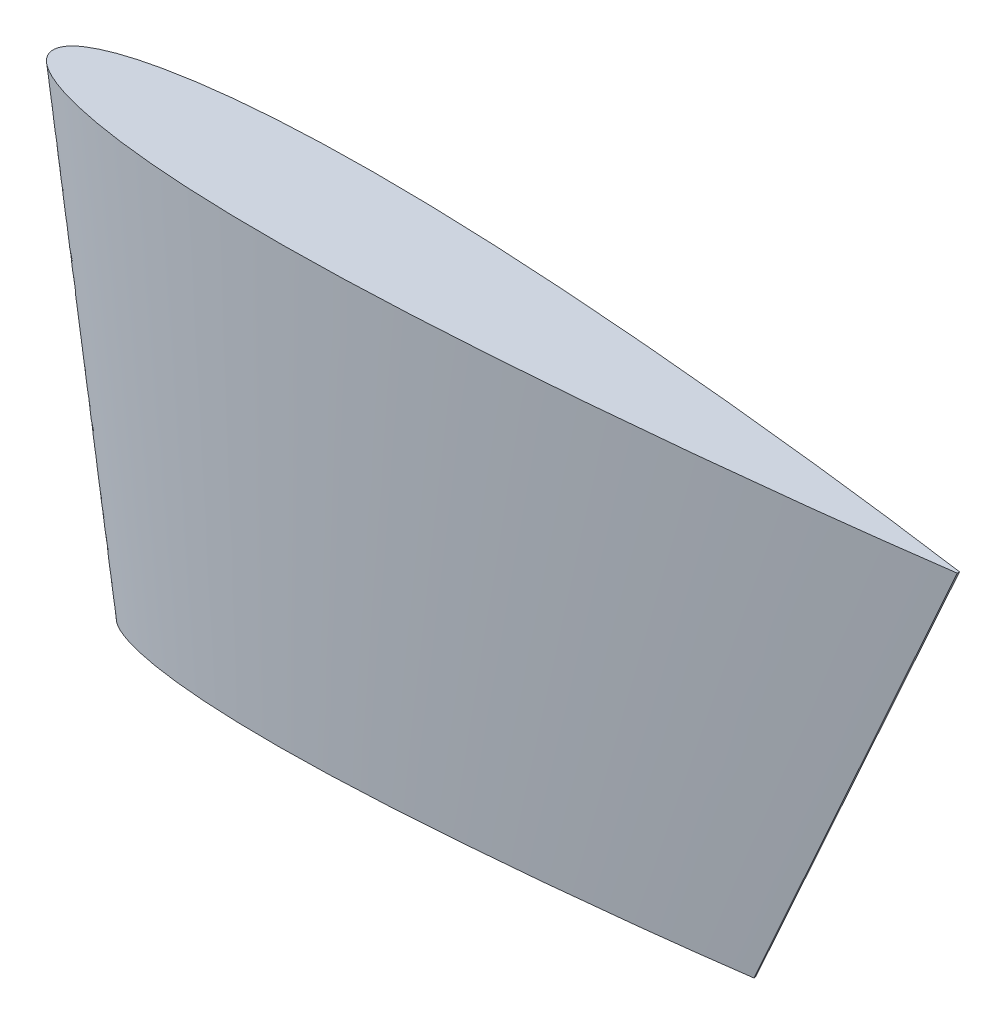
ISO-10303-21;
HEADER;
FILE_DESCRIPTION(('STEP AP214'),'2;1');
FILE_NAME('part.step','',(''),(''),'','','');
FILE_SCHEMA(('AUTOMOTIVE_DESIGN { 1 0 10303 214 1 1 1 1 }'));
ENDSEC;
DATA;
#1=APPLICATION_CONTEXT('core data for automotive mechanical design processes');
#2=APPLICATION_PROTOCOL_DEFINITION('international standard','automotive_design',2000,#1);
#3=PRODUCT_CONTEXT('',#1,'mechanical');
#4=PRODUCT('Part','Part','',(#3));
#5=PRODUCT_RELATED_PRODUCT_CATEGORY('part','',(#4));
#6=PRODUCT_DEFINITION_FORMATION('','',#4);
#7=PRODUCT_DEFINITION_CONTEXT('part definition',#1,'design');
#8=PRODUCT_DEFINITION('design','',#6,#7);
#9=PRODUCT_DEFINITION_SHAPE('','',#8);
#10=(LENGTH_UNIT() NAMED_UNIT(*) SI_UNIT(.MILLI.,.METRE.));
#11=(NAMED_UNIT(*) PLANE_ANGLE_UNIT() SI_UNIT($,.RADIAN.));
#12=(NAMED_UNIT(*) SI_UNIT($,.STERADIAN.) SOLID_ANGLE_UNIT());
#13=UNCERTAINTY_MEASURE_WITH_UNIT(LENGTH_MEASURE(1.E-05),#10,'distance_accuracy_value','');
#14=(GEOMETRIC_REPRESENTATION_CONTEXT(3) GLOBAL_UNCERTAINTY_ASSIGNED_CONTEXT((#13)) GLOBAL_UNIT_ASSIGNED_CONTEXT((#10,
#11,#12)) REPRESENTATION_CONTEXT('',''));
#15=CARTESIAN_POINT('',(0.,0.,0.));
#16=DIRECTION('',(0.,0.,1.));
#17=DIRECTION('',(1.,0.,0.));
#18=AXIS2_PLACEMENT_3D('',#15,#16,#17);
#19=CARTESIAN_POINT('',(0.,0.,0.));
#20=DIRECTION('',(0.,-1.,0.));
#21=DIRECTION('',(0.,0.,-1.));
#22=AXIS2_PLACEMENT_3D('',#19,#20,#21);
#23=PLANE('',#22);
#24=CARTESIAN_POINT('',(152.4,0.,-0.192024));
#25=CARTESIAN_POINT('',(152.370338532884,0.,-0.196184563385604));
#26=CARTESIAN_POINT('',(152.251762960969,0.,-0.212816956550669));
#27=CARTESIAN_POINT('',(151.985232617594,0.,-0.250135614248015));
#28=CARTESIAN_POINT('',(151.541705058351,0.,-0.312085758378577));
#29=CARTESIAN_POINT('',(150.922222429012,0.,-0.398241424578179));
#30=CARTESIAN_POINT('',(150.128220411239,0.,-0.508012662753263));
#31=CARTESIAN_POINT('',(149.161562003337,0.,-0.640702570563287));
#32=CARTESIAN_POINT('',(148.024507935647,0.,-0.795534669857211));
#33=CARTESIAN_POINT('',(146.719698791256,0.,-0.971424113968059));
#34=CARTESIAN_POINT('',(145.25019475784,0.,-1.1674204385122));
#35=CARTESIAN_POINT('',(143.619413968927,0.,-1.38223376352503));
#36=CARTESIAN_POINT('',(141.831182800838,0.,-1.61476826783448));
#37=CARTESIAN_POINT('',(139.889652062668,0.,-1.8635205673098));
#38=CARTESIAN_POINT('',(137.799380396863,0.,-2.12726694462141));
#39=CARTESIAN_POINT('',(135.565236862677,0.,-2.40450872510127));
#40=CARTESIAN_POINT('',(133.192452429258,0.,-2.69386916426055));
#41=CARTESIAN_POINT('',(130.686544779266,0.,-2.9938087865262));
#42=CARTESIAN_POINT('',(128.053380448325,0.,-3.30284675801258));
#43=CARTESIAN_POINT('',(125.299116362894,0.,-3.61951535979661));
#44=CARTESIAN_POINT('',(122.430184480662,0.,-3.94226355136388));
#45=CARTESIAN_POINT('',(119.453275170209,0.,-4.26951458798322));
#46=CARTESIAN_POINT('',(116.375340626462,0.,-4.59979345655401));
#47=CARTESIAN_POINT('',(113.203576723111,0.,-4.93145849917861));
#48=CARTESIAN_POINT('',(109.945388053378,0.,-5.26288658298469));
#49=CARTESIAN_POINT('',(106.60839667466,0.,-5.59251116300805));
#50=CARTESIAN_POINT('',(103.200380957095,0.,-5.91855985842198));
#51=CARTESIAN_POINT('',(99.7293068740157,0.,-6.23944251709353));
#52=CARTESIAN_POINT('',(96.2032774745244,0.,-6.55326476083705));
#53=CARTESIAN_POINT('',(92.630532155618,0.,-6.85832087139749));
#54=CARTESIAN_POINT('',(89.0194131753144,0.,-7.15270200600455));
#55=CARTESIAN_POINT('',(85.3783502256352,0.,-7.43448213806294));
#56=CARTESIAN_POINT('',(81.7158494354458,0.,-7.70181737177012));
#57=CARTESIAN_POINT('',(78.0404599993123,0.,-7.95266743240307));
#58=CARTESIAN_POINT('',(74.3607612767116,0.,-8.18506664642728));
#59=CARTESIAN_POINT('',(70.6853551822504,0.,-8.39706870917708));
#60=CARTESIAN_POINT('',(67.0228164188249,0.,-8.58667155402267));
#61=CARTESIAN_POINT('',(63.3817016128138,0.,-8.75198275199724));
#62=CARTESIAN_POINT('',(59.7705078425938,0.,-8.89112223462125));
#63=CARTESIAN_POINT('',(56.1976698657798,0.,-9.00227212001563));
#64=CARTESIAN_POINT('',(52.6715243428957,0.,-9.08385022068028));
#65=CARTESIAN_POINT('',(49.2003022837029,0.,-9.13428952981387));
#66=CARTESIAN_POINT('',(45.7921123589265,0.,-9.15223580287476));
#67=CARTESIAN_POINT('',(42.4549164263596,0.,-9.13648584820609));
#68=CARTESIAN_POINT('',(39.1965000595328,0.,-9.08613390208933));
#69=CARTESIAN_POINT('',(36.0244643360914,0.,-9.00035979398917));
#70=CARTESIAN_POINT('',(32.9462162558346,0.,-8.87872105763061));
#71=CARTESIAN_POINT('',(29.9689449155695,0.,-8.72100406191527));
#72=CARTESIAN_POINT('',(27.0996036285085,0.,-8.52713483857808));
#73=CARTESIAN_POINT('',(24.3448742926058,0.,-8.29746913936489));
#74=CARTESIAN_POINT('',(21.7111668043941,0.,-8.03254441540473));
#75=CARTESIAN_POINT('',(19.2046291393943,0.,-7.73308064875823));
#76=CARTESIAN_POINT('',(16.8310926599184,0.,-7.40012109616049));
#77=CARTESIAN_POINT('',(14.5960714001381,0.,-7.03484136390966));
#78=CARTESIAN_POINT('',(12.5047241133301,0.,-6.63872383729163));
#79=CARTESIAN_POINT('',(10.561886109842,0.,-6.21318266255167));
#80=CARTESIAN_POINT('',(8.77197428686925,0.,-5.76001216914782));
#81=CARTESIAN_POINT('',(7.13905865945553,0.,-5.28081110509763));
#82=CARTESIAN_POINT('',(5.66673210247375,0.,-4.7774092903727));
#83=CARTESIAN_POINT('',(4.35813743166818,0.,-4.25148725734631));
#84=CARTESIAN_POINT('',(3.21587138800854,0.,-3.70461578837938));
#85=CARTESIAN_POINT('',(2.24194242662648,0.,-3.13804579452405));
#86=CARTESIAN_POINT('',(1.43780829591548,0.,-2.55238578121201));
#87=CARTESIAN_POINT('',(0.804597287250528,0.,-1.94712103074528));
#88=CARTESIAN_POINT('',(0.344416163725508,0.,-1.32007991138518));
#89=CARTESIAN_POINT('',(0.0627824183608324,0.,-0.668579036576483));
#90=CARTESIAN_POINT('',(-0.0306049034041423,0.,0.));
#91=CARTESIAN_POINT('',(0.0627824183608382,0.,0.668579036576509));
#92=CARTESIAN_POINT('',(0.344416163725502,0.,1.32007991138516));
#93=CARTESIAN_POINT('',(0.80459728725053,0.,1.94712103074529));
#94=CARTESIAN_POINT('',(1.43780829591547,0.,2.552385781212));
#95=CARTESIAN_POINT('',(2.24194242662649,0.,3.13804579452406));
#96=CARTESIAN_POINT('',(3.21587138800854,0.,3.70461578837937));
#97=CARTESIAN_POINT('',(4.3581374316682,0.,4.25148725734631));
#98=CARTESIAN_POINT('',(5.66673210247373,0.,4.77740929037269));
#99=CARTESIAN_POINT('',(7.13905865945555,0.,5.28081110509764));
#100=CARTESIAN_POINT('',(8.77197428686923,0.,5.76001216914782));
#101=CARTESIAN_POINT('',(10.561886109842,0.,6.21318266255167));
#102=CARTESIAN_POINT('',(12.5047241133301,0.,6.63872383729163));
#103=CARTESIAN_POINT('',(14.5960714001381,0.,7.03484136390966));
#104=CARTESIAN_POINT('',(16.8310926599184,0.,7.40012109616049));
#105=CARTESIAN_POINT('',(19.2046291393944,0.,7.73308064875823));
#106=CARTESIAN_POINT('',(21.7111668043941,0.,8.03254441540473));
#107=CARTESIAN_POINT('',(24.3448742926058,0.,8.29746913936489));
#108=CARTESIAN_POINT('',(27.0996036285085,0.,8.52713483857808));
#109=CARTESIAN_POINT('',(29.9689449155695,0.,8.72100406191526));
#110=CARTESIAN_POINT('',(32.9462162558347,0.,8.87872105763062));
#111=CARTESIAN_POINT('',(36.0244643360914,0.,9.00035979398917));
#112=CARTESIAN_POINT('',(39.1965000595328,0.,9.08613390208933));
#113=CARTESIAN_POINT('',(42.4549164263596,0.,9.13648584820609));
#114=CARTESIAN_POINT('',(45.7921123589264,0.,9.15223580287476));
#115=CARTESIAN_POINT('',(49.2003022837029,0.,9.13428952981386));
#116=CARTESIAN_POINT('',(52.6715243428957,0.,9.08385022068028));
#117=CARTESIAN_POINT('',(56.1976698657799,0.,9.00227212001563));
#118=CARTESIAN_POINT('',(59.7705078425938,0.,8.89112223462125));
#119=CARTESIAN_POINT('',(63.3817016128138,0.,8.75198275199725));
#120=CARTESIAN_POINT('',(67.0228164188249,0.,8.58667155402266));
#121=CARTESIAN_POINT('',(70.6853551822504,0.,8.39706870917708));
#122=CARTESIAN_POINT('',(74.3607612767117,0.,8.18506664642728));
#123=CARTESIAN_POINT('',(78.0404599993123,0.,7.95266743240307));
#124=CARTESIAN_POINT('',(81.7158494354458,0.,7.70181737177012));
#125=CARTESIAN_POINT('',(85.3783502256352,0.,7.43448213806294));
#126=CARTESIAN_POINT('',(89.0194131753143,0.,7.15270200600455));
#127=CARTESIAN_POINT('',(92.630532155618,0.,6.85832087139749));
#128=CARTESIAN_POINT('',(96.2032774745246,0.,6.55326476083705));
#129=CARTESIAN_POINT('',(99.7293068740156,0.,6.23944251709353));
#130=CARTESIAN_POINT('',(103.200380957095,0.,5.91855985842198));
#131=CARTESIAN_POINT('',(106.60839667466,0.,5.59251116300806));
#132=CARTESIAN_POINT('',(109.945388053378,0.,5.26288658298468));
#133=CARTESIAN_POINT('',(113.203576723111,0.,4.93145849917861));
#134=CARTESIAN_POINT('',(116.375340626462,0.,4.59979345655401));
#135=CARTESIAN_POINT('',(119.453275170209,0.,4.26951458798322));
#136=CARTESIAN_POINT('',(122.430184480662,0.,3.94226355136388));
#137=CARTESIAN_POINT('',(125.299116362894,0.,3.61951535979661));
#138=CARTESIAN_POINT('',(128.053380448325,0.,3.30284675801258));
#139=CARTESIAN_POINT('',(130.686544779266,0.,2.9938087865262));
#140=CARTESIAN_POINT('',(133.192452429258,0.,2.69386916426055));
#141=CARTESIAN_POINT('',(135.565236862677,0.,2.40450872510127));
#142=CARTESIAN_POINT('',(137.799380396863,0.,2.12726694462141));
#143=CARTESIAN_POINT('',(139.889652062668,0.,1.8635205673098));
#144=CARTESIAN_POINT('',(141.831182800838,0.,1.61476826783449));
#145=CARTESIAN_POINT('',(143.619413968928,0.,1.38223376352503));
#146=CARTESIAN_POINT('',(145.25019475784,0.,1.1674204385122));
#147=CARTESIAN_POINT('',(146.719698791256,0.,0.971424113968061));
#148=CARTESIAN_POINT('',(148.024507935647,0.,0.795534669857208));
#149=CARTESIAN_POINT('',(149.161562003336,0.,0.640702570563289));
#150=CARTESIAN_POINT('',(150.128220411239,0.,0.508012662753264));
#151=CARTESIAN_POINT('',(150.922222429012,0.,0.398241424578179));
#152=CARTESIAN_POINT('',(151.54170505835,0.,0.31208575837858));
#153=CARTESIAN_POINT('',(151.985232617594,0.,0.250135614248006));
#154=CARTESIAN_POINT('',(152.251762960969,0.,0.212816956550677));
#155=CARTESIAN_POINT('',(152.370338532884,0.,0.196184563385604));
#156=CARTESIAN_POINT('',(152.4,0.,0.192024));
#157=B_SPLINE_CURVE_WITH_KNOTS('',3,(#24,#25,#26,#27,#28,#29,#30,#31,#32,#33,#34,#35,#36,#37,
#38,#39,#40,#41,#42,#43,#44,#45,#46,#47,#48,#49,#50,#51,#52,#53,#54,#55,#56,#57,#58,#59,#60,#61,
#62,#63,#64,#65,#66,#67,#68,#69,#70,#71,#72,#73,#74,#75,#76,#77,#78,#79,#80,#81,#82,#83,#84,#85,
#86,#87,#88,#89,#90,#91,#92,#93,#94,#95,#96,#97,#98,#99,#100,#101,#102,#103,#104,#105,#106,#107,
#108,#109,#110,#111,#112,#113,#114,#115,#116,#117,#118,#119,#120,#121,#122,#123,#124,#125,#126,
#127,#128,#129,#130,#131,#132,#133,#134,#135,#136,#137,#138,#139,#140,#141,#142,#143,#144,#145,
#146,#147,#148,#149,#150,#151,#152,#153,#154,#155,#156),.UNSPECIFIED.,.F.,.F.,(4,1,1,1,1,1,1,1,
1,1,1,1,1,1,1,1,1,1,1,1,1,1,1,1,1,1,1,1,1,1,1,1,1,1,1,1,1,1,1,1,1,1,1,1,1,1,1,1,1,1,1,1,1,1,1,1,
1,1,1,1,1,1,1,1,1,1,1,1,1,1,1,1,1,1,1,1,1,1,1,1,1,1,1,1,1,1,1,1,1,1,1,1,1,1,1,1,1,1,1,1,1,1,1,1,
1,1,1,1,1,1,1,1,1,1,1,1,1,1,1,1,1,1,1,1,1,1,1,1,1,1,4),(0.,0.000289139829629297,
0.00115587406809233,0.00259804648620111,0.0046122925242988,0.00719360142710374,
0.0103358398991138,0.0140314220913043,0.0182714359610244,0.0230457255123808,0.028342880171931,
0.0341501461629426,0.0404537273712038,0.0472386218431875,0.0544885452057086,0.0621864184567662,
0.0703139502736332,0.0788519467249039,0.0877800883609476,0.0970773446039016,0.106721824454286,
0.116690740892026,0.126960694728489,0.13750732119189,0.14830589784927,0.159331037464912,
0.170556733734794,0.181956692412489,0.193504006621146,0.205171610926845,0.216932143777857,
0.228757966329757,0.240621466795955,0.252494880114754,0.264350513454881,0.276160748683231,
0.287898286461392,0.299535932758038,0.311046943870827,0.322404990071825,0.333584264347777,
0.344559445097454,0.355305867410276,0.365799637181357,0.376017640202703,0.385937539745688,
0.395537839242619,0.404798063044776,0.413698795251114,0.422221663138462,0.430349482374301,
0.438066166572283,0.445357142004528,0.452209429052352,0.458611476419824,0.46455400548229,
0.470029947259275,0.475035104452568,0.479569182705939,0.483636922291976,0.487250217431857,
0.490431510097779,0.49321884899948,0.495674068819139,0.49789121366491,0.5,0.50210878633509,
0.504325931180861,0.50678115100052,0.50956848990222,0.512749782568143,0.516363077708024,
0.520430817294061,0.524964895547432,0.529970052740725,0.53544599451771,0.541388523580176,
0.547790570947647,0.554642857995472,0.561933833427716,0.569650517625699,0.577778336861538,
0.586301204748886,0.595201936955223,0.604462160757381,0.614062460254312,0.623982359797297,
0.634200362818643,0.644694132589724,0.655440554902546,0.666415735652223,0.677595009928175,
0.688953056129173,0.700464067241962,0.712101713538608,0.723839251316769,0.735649486545119,
0.747505119885246,0.759378533204045,0.771242033670243,0.783067856222143,0.794828389073155,
0.806495993378855,0.818043307587511,0.829443266265206,0.840668962535088,0.85169410215073,
0.86249267880811,0.873039305271511,0.883309259107974,0.893278175545714,0.902922655396098,
0.912219911639052,0.921148053275096,0.929686049726367,0.937813581543234,0.945511454794291,
0.952761378156812,0.959546272628796,0.965849853837057,0.971657119828069,0.976954274487619,
0.981728564038976,0.985968577908696,0.989664160100886,0.992806398572896,0.995387707475701,
0.997401953513799,0.998844125931908,0.999710860170371,1.),.UNSPECIFIED.);
#158=CARTESIAN_POINT('',(152.4,0.,-0.192024));
#159=VERTEX_POINT('',#158);
#160=CARTESIAN_POINT('',(152.4,0.,0.192024));
#161=VERTEX_POINT('',#160);
#162=EDGE_CURVE('E61',#159,#161,#157,.T.);
#163=ORIENTED_EDGE('',*,*,#162,.T.);
#164=DIRECTION('',(0.,0.,-1.));
#165=VECTOR('',#164,1.);
#166=CARTESIAN_POINT('',(152.4,0.,-0.192024));
#167=LINE('',#166,#165);
#168=EDGE_CURVE('E12',#161,#159,#167,.T.);
#169=ORIENTED_EDGE('',*,*,#168,.T.);
#170=EDGE_LOOP('',(#163,#169));
#171=FACE_BOUND('',#170,.T.);
#172=ADVANCED_FACE('F51',(#171),#23,.F.);
#173=CARTESIAN_POINT('',(11.4300000000023,-76.1999999999994,0.));
#174=DIRECTION('',(0.,-1.,0.));
#175=DIRECTION('',(0.,0.,-1.));
#176=AXIS2_PLACEMENT_3D('',#173,#174,#175);
#177=PLANE('',#176);
#178=CARTESIAN_POINT('',(118.110000000002,-76.1999999999994,-0.1344168));
#179=CARTESIAN_POINT('',(118.089236973021,-76.1999999999994,-0.137329194369924));
#180=CARTESIAN_POINT('',(118.006234072681,-76.1999999999994,-0.148971869585466));
#181=CARTESIAN_POINT('',(117.819662832318,-76.1999999999994,-0.175094929973612));
#182=CARTESIAN_POINT('',(117.509193540848,-76.1999999999994,-0.218460030865003));
#183=CARTESIAN_POINT('',(117.07555570031,-76.1999999999994,-0.278768997204722));
#184=CARTESIAN_POINT('',(116.519754287869,-76.1999999999994,-0.355608863927284));
#185=CARTESIAN_POINT('',(115.843093402338,-76.1999999999994,-0.448491799394302));
#186=CARTESIAN_POINT('',(115.047155554955,-76.1999999999994,-0.556874268900048));
#187=CARTESIAN_POINT('',(114.133789153882,-76.1999999999994,-0.679996879777643));
#188=CARTESIAN_POINT('',(113.10513633049,-76.1999999999994,-0.817194306958535));
#189=CARTESIAN_POINT('',(111.963589778252,-76.1999999999994,-0.967563634467527));
#190=CARTESIAN_POINT('',(110.711827960589,-76.1999999999994,-1.13033778748414));
#191=CARTESIAN_POINT('',(109.35275644387,-76.1999999999994,-1.30446439711687));
#192=CARTESIAN_POINT('',(107.889566277807,-76.1999999999994,-1.48908686123499));
#193=CARTESIAN_POINT('',(106.325665803876,-76.1999999999994,-1.68315610757089));
#194=CARTESIAN_POINT('',(104.664716700483,-76.1999999999994,-1.88570841498238));
#195=CARTESIAN_POINT('',(102.910581345489,-76.1999999999994,-2.09566615056835));
#196=CARTESIAN_POINT('',(101.06736631383,-76.1999999999994,-2.31199273060878));
#197=CARTESIAN_POINT('',(99.1393814540284,-76.1999999999994,-2.53366075185763));
#198=CARTESIAN_POINT('',(97.1311291364658,-76.1999999999994,-2.75958448595473));
#199=CARTESIAN_POINT('',(95.0472926191489,-76.1999999999994,-2.98866021158825));
#200=CARTESIAN_POINT('',(92.8927384385256,-76.1999999999994,-3.21985541958779));
#201=CARTESIAN_POINT('',(90.67250370618,-76.1999999999994,-3.45202094942502));
#202=CARTESIAN_POINT('',(88.3917716373661,-76.1999999999994,-3.68402060808926));
#203=CARTESIAN_POINT('',(86.0558776722644,-76.1999999999994,-3.91475781410564));
#204=CARTESIAN_POINT('',(83.6702666699684,-76.1999999999994,-4.14299190089537));
#205=CARTESIAN_POINT('',(81.2405148118139,-76.1999999999994,-4.36760976196542));
#206=CARTESIAN_POINT('',(78.7722942321698,-76.1999999999994,-4.58728533258594));
#207=CARTESIAN_POINT('',(76.271372508935,-76.1999999999994,-4.80082460997821));
#208=CARTESIAN_POINT('',(73.7435892227221,-76.1999999999994,-5.00689140420312));
#209=CARTESIAN_POINT('',(71.1948451579466,-76.1999999999994,-5.20413749664405));
#210=CARTESIAN_POINT('',(68.6310946048146,-76.1999999999994,-5.39127216023905));
#211=CARTESIAN_POINT('',(66.0583219995208,-76.1999999999994,-5.5668672026822));
#212=CARTESIAN_POINT('',(63.4825328937004,-76.1999999999994,-5.72954665249912));
#213=CARTESIAN_POINT('',(60.9097486275773,-76.1999999999994,-5.87794809642394));
#214=CARTESIAN_POINT('',(58.3459714931796,-76.1999999999994,-6.01067008781586));
#215=CARTESIAN_POINT('',(55.7971911289716,-76.1999999999994,-6.12638792639808));
#216=CARTESIAN_POINT('',(53.2693554898181,-76.1999999999994,-6.22378556423486));
#217=CARTESIAN_POINT('',(50.7683689060483,-76.1999999999994,-6.30159048401092));
#218=CARTESIAN_POINT('',(48.3000670400285,-76.1999999999994,-6.35869515447621));
#219=CARTESIAN_POINT('',(45.8702115985942,-76.1999999999994,-6.39400267086971));
#220=CARTESIAN_POINT('',(43.4844786512511,-76.1999999999994,-6.4065650620123));
#221=CARTESIAN_POINT('',(41.148441498454,-76.1999999999994,-6.39554009374426));
#222=CARTESIAN_POINT('',(38.8675500416747,-76.1999999999994,-6.3602937314625));
#223=CARTESIAN_POINT('',(36.6471250352664,-76.1999999999994,-6.30025185579241));
#224=CARTESIAN_POINT('',(34.4923513790868,-76.1999999999994,-6.21510474034138));
#225=CARTESIAN_POINT('',(32.4082614409003,-76.1999999999994,-6.10470284334067));
#226=CARTESIAN_POINT('',(30.3997225399586,-76.1999999999994,-5.96899438700465));
#227=CARTESIAN_POINT('',(28.4714120048262,-76.1999999999994,-5.80822839755542));
#228=CARTESIAN_POINT('',(26.6278167630781,-76.1999999999994,-5.62278109078331));
#229=CARTESIAN_POINT('',(24.8732403975783,-76.1999999999994,-5.41315645413071));
#230=CARTESIAN_POINT('',(23.2117648619452,-76.1999999999994,-5.18008476731229));
#231=CARTESIAN_POINT('',(21.6472499800985,-76.1999999999994,-4.92438895473677));
#232=CARTESIAN_POINT('',(20.1833068793331,-76.1999999999994,-4.64710668610409));
#233=CARTESIAN_POINT('',(18.8233202768918,-76.1999999999994,-4.34922786378616));
#234=CARTESIAN_POINT('',(17.5703820008114,-76.1999999999994,-4.03200851840346));
#235=CARTESIAN_POINT('',(16.427341061621,-76.1999999999994,-3.69656777356831));
#236=CARTESIAN_POINT('',(15.3967124717339,-76.1999999999994,-3.34418650326087));
#237=CARTESIAN_POINT('',(14.4806962021704,-76.1999999999994,-2.97604108014237));
#238=CARTESIAN_POINT('',(13.681109971608,-76.1999999999994,-2.59323105186556));
#239=CARTESIAN_POINT('',(12.9993596986405,-76.1999999999994,-2.1966320561668));
#240=CARTESIAN_POINT('',(12.4364658071427,-76.1999999999994,-1.78667004684839));
#241=CARTESIAN_POINT('',(11.9932181010775,-76.1999999999994,-1.36298472152169));
#242=CARTESIAN_POINT('',(11.6710913146101,-76.1999999999994,-0.924055937969606));
#243=CARTESIAN_POINT('',(11.4739476928552,-76.1999999999994,-0.468005325603518));
#244=CARTESIAN_POINT('',(11.4085765676194,-76.1999999999994,0.));
#245=CARTESIAN_POINT('',(11.4739476928546,-76.1999999999994,0.468005325603575));
#246=CARTESIAN_POINT('',(11.6710913146097,-76.1999999999994,0.924055937969634));
#247=CARTESIAN_POINT('',(11.9932181010781,-76.1999999999994,1.36298472152173));
#248=CARTESIAN_POINT('',(12.4364658071434,-76.1999999999994,1.78667004684842));
#249=CARTESIAN_POINT('',(12.9993596986403,-76.1999999999994,2.19663205616686));
#250=CARTESIAN_POINT('',(13.6811099716084,-76.1999999999994,2.59323105186558));
#251=CARTESIAN_POINT('',(14.48069620217,-76.1999999999994,2.97604108014245));
#252=CARTESIAN_POINT('',(15.3967124717334,-76.1999999999994,3.3441865032609));
#253=CARTESIAN_POINT('',(16.427341061622,-76.1999999999994,3.69656777356839));
#254=CARTESIAN_POINT('',(17.5703820008107,-76.1999999999994,4.03200851840348));
#255=CARTESIAN_POINT('',(18.8233202768914,-76.1999999999994,4.34922786378619));
#256=CARTESIAN_POINT('',(20.1833068793327,-76.1999999999994,4.64710668610416));
#257=CARTESIAN_POINT('',(21.6472499800988,-76.1999999999994,4.92438895473679));
#258=CARTESIAN_POINT('',(23.2117648619453,-76.1999999999994,5.18008476731236));
#259=CARTESIAN_POINT('',(24.8732403975778,-76.1999999999994,5.41315645413077));
#260=CARTESIAN_POINT('',(26.6278167630779,-76.1999999999994,5.62278109078331));
#261=CARTESIAN_POINT('',(28.4714120048264,-76.1999999999994,5.80822839755545));
#262=CARTESIAN_POINT('',(30.3997225399576,-76.1999999999994,5.96899438700465));
#263=CARTESIAN_POINT('',(32.4082614409008,-76.1999999999994,6.10470284334072));
#264=CARTESIAN_POINT('',(34.4923513790866,-76.1999999999994,6.21510474034146));
#265=CARTESIAN_POINT('',(36.6471250352675,-76.1999999999994,6.3002518557924));
#266=CARTESIAN_POINT('',(38.8675500416749,-76.1999999999994,6.36029373146252));
#267=CARTESIAN_POINT('',(41.1484414984542,-76.1999999999994,6.3955400937443));
#268=CARTESIAN_POINT('',(43.4844786512509,-76.1999999999994,6.40656506201235));
#269=CARTESIAN_POINT('',(45.8702115985946,-76.1999999999994,6.39400267086974));
#270=CARTESIAN_POINT('',(48.3000670400292,-76.1999999999994,6.35869515447622));
#271=CARTESIAN_POINT('',(50.7683689060489,-76.1999999999994,6.30159048401095));
#272=CARTESIAN_POINT('',(53.2693554898178,-76.1999999999994,6.22378556423484));
#273=CARTESIAN_POINT('',(55.7971911289719,-76.1999999999994,6.12638792639808));
#274=CARTESIAN_POINT('',(58.3459714931798,-76.1999999999994,6.01067008781587));
#275=CARTESIAN_POINT('',(60.9097486275777,-76.1999999999994,5.87794809642397));
#276=CARTESIAN_POINT('',(63.4825328937007,-76.1999999999994,5.72954665249908));
#277=CARTESIAN_POINT('',(66.0583219995211,-76.1999999999994,5.56686720268216));
#278=CARTESIAN_POINT('',(68.6310946048141,-76.1999999999994,5.39127216023913));
#279=CARTESIAN_POINT('',(71.1948451579467,-76.1999999999994,5.2041374966441));
#280=CARTESIAN_POINT('',(73.7435892227224,-76.1999999999994,5.00689140420322));
#281=CARTESIAN_POINT('',(76.2713725089349,-76.1999999999994,4.80082460997827));
#282=CARTESIAN_POINT('',(78.7722942321696,-76.1999999999994,4.58728533258591));
#283=CARTESIAN_POINT('',(81.2405148118129,-76.1999999999994,4.36760976196549));
#284=CARTESIAN_POINT('',(83.6702666699691,-76.1999999999994,4.14299190089539));
#285=CARTESIAN_POINT('',(86.0558776722649,-76.1999999999994,3.91475781410566));
#286=CARTESIAN_POINT('',(88.3917716373674,-76.1999999999994,3.68402060808928));
#287=CARTESIAN_POINT('',(90.6725037061801,-76.1999999999994,3.45202094942502));
#288=CARTESIAN_POINT('',(92.8927384385253,-76.1999999999994,3.21985541958781));
#289=CARTESIAN_POINT('',(95.0472926191482,-76.1999999999994,2.98866021158824));
#290=CARTESIAN_POINT('',(97.1311291364657,-76.1999999999994,2.75958448595473));
#291=CARTESIAN_POINT('',(99.1393814540278,-76.1999999999994,2.53366075185762));
#292=CARTESIAN_POINT('',(101.06736631383,-76.1999999999994,2.31199273060881));
#293=CARTESIAN_POINT('',(102.910581345488,-76.1999999999994,2.09566615056833));
#294=CARTESIAN_POINT('',(104.664716700484,-76.1999999999994,1.88570841498237));
#295=CARTESIAN_POINT('',(106.325665803876,-76.1999999999994,1.68315610757088));
#296=CARTESIAN_POINT('',(107.889566277806,-76.1999999999994,1.48908686123499));
#297=CARTESIAN_POINT('',(109.35275644387,-76.1999999999994,1.30446439711685));
#298=CARTESIAN_POINT('',(110.711827960589,-76.1999999999994,1.13033778748414));
#299=CARTESIAN_POINT('',(111.963589778252,-76.1999999999994,0.96756363446752));
#300=CARTESIAN_POINT('',(113.10513633049,-76.1999999999994,0.817194306958542));
#301=CARTESIAN_POINT('',(114.133789153882,-76.1999999999994,0.679996879777642));
#302=CARTESIAN_POINT('',(115.047155554955,-76.1999999999994,0.556874268900047));
#303=CARTESIAN_POINT('',(115.843093402338,-76.1999999999994,0.448491799394302));
#304=CARTESIAN_POINT('',(116.519754287869,-76.1999999999994,0.355608863927286));
#305=CARTESIAN_POINT('',(117.07555570031,-76.1999999999994,0.278768997204727));
#306=CARTESIAN_POINT('',(117.509193540848,-76.1999999999994,0.218460030865005));
#307=CARTESIAN_POINT('',(117.819662832318,-76.1999999999994,0.175094929973605));
#308=CARTESIAN_POINT('',(118.006234072681,-76.1999999999994,0.148971869585473));
#309=CARTESIAN_POINT('',(118.089236973021,-76.1999999999994,0.137329194369923));
#310=CARTESIAN_POINT('',(118.110000000002,-76.1999999999994,0.1344168));
#311=B_SPLINE_CURVE_WITH_KNOTS('',3,(#178,#179,#180,#181,#182,#183,#184,#185,#186,#187,#188,
#189,#190,#191,#192,#193,#194,#195,#196,#197,#198,#199,#200,#201,#202,#203,#204,#205,#206,#207,
#208,#209,#210,#211,#212,#213,#214,#215,#216,#217,#218,#219,#220,#221,#222,#223,#224,#225,#226,
#227,#228,#229,#230,#231,#232,#233,#234,#235,#236,#237,#238,#239,#240,#241,#242,#243,#244,#245,
#246,#247,#248,#249,#250,#251,#252,#253,#254,#255,#256,#257,#258,#259,#260,#261,#262,#263,#264,
#265,#266,#267,#268,#269,#270,#271,#272,#273,#274,#275,#276,#277,#278,#279,#280,#281,#282,#283,
#284,#285,#286,#287,#288,#289,#290,#291,#292,#293,#294,#295,#296,#297,#298,#299,#300,#301,#302,
#303,#304,#305,#306,#307,#308,#309,#310),.UNSPECIFIED.,.F.,.F.,(4,1,1,1,1,1,1,1,1,1,1,1,1,1,1,1,
1,1,1,1,1,1,1,1,1,1,1,1,1,1,1,1,1,1,1,1,1,1,1,1,1,1,1,1,1,1,1,1,1,1,1,1,1,1,1,1,1,1,1,1,1,1,1,1,
1,1,1,1,1,1,1,1,1,1,1,1,1,1,1,1,1,1,1,1,1,1,1,1,1,1,1,1,1,1,1,1,1,1,1,1,1,1,1,1,1,1,1,1,1,1,1,1,
1,1,1,1,1,1,1,1,1,1,1,1,1,1,1,1,1,1,4),(0.,0.000289139829629297,0.00115587406809233,
0.00259804648620111,0.0046122925242988,0.00719360142710374,0.0103358398991138,
0.0140314220913043,0.0182714359610244,0.0230457255123808,0.028342880171931,0.0341501461629426,
0.0404537273712038,0.0472386218431875,0.0544885452057086,0.0621864184567662,0.0703139502736332,
0.0788519467249039,0.0877800883609476,0.0970773446039016,0.106721824454286,0.116690740892026,
0.126960694728489,0.13750732119189,0.14830589784927,0.159331037464912,0.170556733734794,
0.181956692412489,0.193504006621146,0.205171610926845,0.216932143777857,0.228757966329757,
0.240621466795955,0.252494880114754,0.264350513454881,0.276160748683231,0.287898286461392,
0.299535932758038,0.311046943870827,0.322404990071825,0.333584264347777,0.344559445097454,
0.355305867410276,0.365799637181357,0.376017640202703,0.385937539745688,0.395537839242619,
0.404798063044776,0.413698795251114,0.422221663138462,0.430349482374301,0.438066166572283,
0.445357142004528,0.452209429052352,0.458611476419824,0.46455400548229,0.470029947259275,
0.475035104452568,0.479569182705939,0.483636922291976,0.487250217431857,0.490431510097779,
0.49321884899948,0.495674068819139,0.49789121366491,0.5,0.50210878633509,0.504325931180861,
0.50678115100052,0.50956848990222,0.512749782568143,0.516363077708024,0.520430817294061,
0.524964895547432,0.529970052740725,0.53544599451771,0.541388523580176,0.547790570947647,
0.554642857995472,0.561933833427716,0.569650517625699,0.577778336861538,0.586301204748886,
0.595201936955223,0.604462160757381,0.614062460254312,0.623982359797297,0.634200362818643,
0.644694132589724,0.655440554902546,0.666415735652223,0.677595009928175,0.688953056129173,
0.700464067241962,0.712101713538608,0.723839251316769,0.735649486545119,0.747505119885246,
0.759378533204045,0.771242033670243,0.783067856222143,0.794828389073155,0.806495993378855,
0.818043307587511,0.829443266265206,0.840668962535088,0.85169410215073,0.86249267880811,
0.873039305271511,0.883309259107974,0.893278175545714,0.902922655396098,0.912219911639052,
0.921148053275096,0.929686049726367,0.937813581543234,0.945511454794291,0.952761378156812,
0.959546272628796,0.965849853837057,0.971657119828069,0.976954274487619,0.981728564038976,
0.985968577908696,0.989664160100886,0.992806398572896,0.995387707475701,0.997401953513799,
0.998844125931908,0.999710860170371,1.),.UNSPECIFIED.);
#312=CARTESIAN_POINT('',(118.110000000002,-76.1999999999994,-0.1344168));
#313=VERTEX_POINT('',#312);
#314=CARTESIAN_POINT('',(118.110000000002,-76.1999999999994,0.1344168));
#315=VERTEX_POINT('',#314);
#316=EDGE_CURVE('E85',#313,#315,#311,.T.);
#317=ORIENTED_EDGE('',*,*,#316,.F.);
#318=DIRECTION('',(0.,0.,-1.));
#319=VECTOR('',#318,1.);
#320=CARTESIAN_POINT('',(118.110000000002,-76.1999999999994,-0.1344168));
#321=LINE('',#320,#319);
#322=EDGE_CURVE('E89',#315,#313,#321,.T.);
#323=ORIENTED_EDGE('',*,*,#322,.F.);
#324=EDGE_LOOP('',(#317,#323));
#325=FACE_BOUND('',#324,.T.);
#326=ADVANCED_FACE('F98',(#325),#177,.T.);
#327=CARTESIAN_POINT('',(118.110000000002,-76.1999999999994,-0.1344168));
#328=CARTESIAN_POINT('',(152.4,0.,-0.192024));
#329=CARTESIAN_POINT('',(118.089236973021,-76.1999999999994,-0.137329194369924));
#330=CARTESIAN_POINT('',(152.370338532884,0.,-0.196184563385604));
#331=CARTESIAN_POINT('',(118.006234072681,-76.1999999999994,-0.148971869585466));
#332=CARTESIAN_POINT('',(152.251762960969,0.,-0.212816956550669));
#333=CARTESIAN_POINT('',(117.819662832318,-76.1999999999994,-0.175094929973612));
#334=CARTESIAN_POINT('',(151.985232617594,0.,-0.250135614248015));
#335=CARTESIAN_POINT('',(117.509193540848,-76.1999999999994,-0.218460030865003));
#336=CARTESIAN_POINT('',(151.541705058351,0.,-0.312085758378577));
#337=CARTESIAN_POINT('',(117.07555570031,-76.1999999999994,-0.278768997204722));
#338=CARTESIAN_POINT('',(150.922222429012,0.,-0.398241424578179));
#339=CARTESIAN_POINT('',(116.519754287869,-76.1999999999994,-0.355608863927284));
#340=CARTESIAN_POINT('',(150.128220411239,0.,-0.508012662753263));
#341=CARTESIAN_POINT('',(115.843093402338,-76.1999999999994,-0.448491799394302));
#342=CARTESIAN_POINT('',(149.161562003337,0.,-0.640702570563287));
#343=CARTESIAN_POINT('',(115.047155554955,-76.1999999999994,-0.556874268900048));
#344=CARTESIAN_POINT('',(148.024507935647,0.,-0.795534669857211));
#345=CARTESIAN_POINT('',(114.133789153882,-76.1999999999994,-0.679996879777643));
#346=CARTESIAN_POINT('',(146.719698791256,0.,-0.971424113968059));
#347=CARTESIAN_POINT('',(113.10513633049,-76.1999999999994,-0.817194306958535));
#348=CARTESIAN_POINT('',(145.25019475784,0.,-1.1674204385122));
#349=CARTESIAN_POINT('',(111.963589778252,-76.1999999999994,-0.967563634467527));
#350=CARTESIAN_POINT('',(143.619413968927,0.,-1.38223376352503));
#351=CARTESIAN_POINT('',(110.711827960589,-76.1999999999994,-1.13033778748414));
#352=CARTESIAN_POINT('',(141.831182800838,0.,-1.61476826783448));
#353=CARTESIAN_POINT('',(109.35275644387,-76.1999999999994,-1.30446439711687));
#354=CARTESIAN_POINT('',(139.889652062668,0.,-1.8635205673098));
#355=CARTESIAN_POINT('',(107.889566277807,-76.1999999999994,-1.48908686123499));
#356=CARTESIAN_POINT('',(137.799380396863,0.,-2.12726694462141));
#357=CARTESIAN_POINT('',(106.325665803876,-76.1999999999994,-1.68315610757089));
#358=CARTESIAN_POINT('',(135.565236862677,0.,-2.40450872510127));
#359=CARTESIAN_POINT('',(104.664716700483,-76.1999999999994,-1.88570841498238));
#360=CARTESIAN_POINT('',(133.192452429258,0.,-2.69386916426055));
#361=CARTESIAN_POINT('',(102.910581345489,-76.1999999999994,-2.09566615056835));
#362=CARTESIAN_POINT('',(130.686544779266,0.,-2.9938087865262));
#363=CARTESIAN_POINT('',(101.06736631383,-76.1999999999994,-2.31199273060878));
#364=CARTESIAN_POINT('',(128.053380448325,0.,-3.30284675801258));
#365=CARTESIAN_POINT('',(99.1393814540284,-76.1999999999994,-2.53366075185763));
#366=CARTESIAN_POINT('',(125.299116362894,0.,-3.61951535979661));
#367=CARTESIAN_POINT('',(97.1311291364658,-76.1999999999994,-2.75958448595473));
#368=CARTESIAN_POINT('',(122.430184480662,0.,-3.94226355136388));
#369=CARTESIAN_POINT('',(95.0472926191489,-76.1999999999994,-2.98866021158825));
#370=CARTESIAN_POINT('',(119.453275170209,0.,-4.26951458798322));
#371=CARTESIAN_POINT('',(92.8927384385256,-76.1999999999994,-3.21985541958779));
#372=CARTESIAN_POINT('',(116.375340626462,0.,-4.59979345655401));
#373=CARTESIAN_POINT('',(90.67250370618,-76.1999999999994,-3.45202094942502));
#374=CARTESIAN_POINT('',(113.203576723111,0.,-4.93145849917861));
#375=CARTESIAN_POINT('',(88.3917716373661,-76.1999999999994,-3.68402060808926));
#376=CARTESIAN_POINT('',(109.945388053378,0.,-5.26288658298469));
#377=CARTESIAN_POINT('',(86.0558776722644,-76.1999999999994,-3.91475781410564));
#378=CARTESIAN_POINT('',(106.60839667466,0.,-5.59251116300805));
#379=CARTESIAN_POINT('',(83.6702666699684,-76.1999999999994,-4.14299190089537));
#380=CARTESIAN_POINT('',(103.200380957095,0.,-5.91855985842198));
#381=CARTESIAN_POINT('',(81.2405148118139,-76.1999999999994,-4.36760976196542));
#382=CARTESIAN_POINT('',(99.7293068740157,0.,-6.23944251709353));
#383=CARTESIAN_POINT('',(78.7722942321698,-76.1999999999994,-4.58728533258594));
#384=CARTESIAN_POINT('',(96.2032774745244,0.,-6.55326476083705));
#385=CARTESIAN_POINT('',(76.271372508935,-76.1999999999994,-4.80082460997821));
#386=CARTESIAN_POINT('',(92.630532155618,0.,-6.85832087139749));
#387=CARTESIAN_POINT('',(73.7435892227221,-76.1999999999994,-5.00689140420312));
#388=CARTESIAN_POINT('',(89.0194131753144,0.,-7.15270200600455));
#389=CARTESIAN_POINT('',(71.1948451579466,-76.1999999999994,-5.20413749664405));
#390=CARTESIAN_POINT('',(85.3783502256352,0.,-7.43448213806294));
#391=CARTESIAN_POINT('',(68.6310946048146,-76.1999999999994,-5.39127216023905));
#392=CARTESIAN_POINT('',(81.7158494354458,0.,-7.70181737177012));
#393=CARTESIAN_POINT('',(66.0583219995208,-76.1999999999994,-5.5668672026822));
#394=CARTESIAN_POINT('',(78.0404599993123,0.,-7.95266743240307));
#395=CARTESIAN_POINT('',(63.4825328937004,-76.1999999999994,-5.72954665249912));
#396=CARTESIAN_POINT('',(74.3607612767116,0.,-8.18506664642728));
#397=CARTESIAN_POINT('',(60.9097486275773,-76.1999999999994,-5.87794809642394));
#398=CARTESIAN_POINT('',(70.6853551822504,0.,-8.39706870917708));
#399=CARTESIAN_POINT('',(58.3459714931796,-76.1999999999994,-6.01067008781586));
#400=CARTESIAN_POINT('',(67.0228164188249,0.,-8.58667155402267));
#401=CARTESIAN_POINT('',(55.7971911289716,-76.1999999999994,-6.12638792639808));
#402=CARTESIAN_POINT('',(63.3817016128138,0.,-8.75198275199724));
#403=CARTESIAN_POINT('',(53.2693554898181,-76.1999999999994,-6.22378556423486));
#404=CARTESIAN_POINT('',(59.7705078425938,0.,-8.89112223462125));
#405=CARTESIAN_POINT('',(50.7683689060483,-76.1999999999994,-6.30159048401092));
#406=CARTESIAN_POINT('',(56.1976698657798,0.,-9.00227212001563));
#407=CARTESIAN_POINT('',(48.3000670400285,-76.1999999999994,-6.35869515447621));
#408=CARTESIAN_POINT('',(52.6715243428957,0.,-9.08385022068028));
#409=CARTESIAN_POINT('',(45.8702115985942,-76.1999999999994,-6.39400267086971));
#410=CARTESIAN_POINT('',(49.2003022837029,0.,-9.13428952981387));
#411=CARTESIAN_POINT('',(43.4844786512511,-76.1999999999994,-6.4065650620123));
#412=CARTESIAN_POINT('',(45.7921123589265,0.,-9.15223580287476));
#413=CARTESIAN_POINT('',(41.148441498454,-76.1999999999994,-6.39554009374426));
#414=CARTESIAN_POINT('',(42.4549164263596,0.,-9.13648584820609));
#415=CARTESIAN_POINT('',(38.8675500416747,-76.1999999999994,-6.3602937314625));
#416=CARTESIAN_POINT('',(39.1965000595328,0.,-9.08613390208933));
#417=CARTESIAN_POINT('',(36.6471250352664,-76.1999999999994,-6.30025185579241));
#418=CARTESIAN_POINT('',(36.0244643360914,0.,-9.00035979398917));
#419=CARTESIAN_POINT('',(34.4923513790868,-76.1999999999994,-6.21510474034138));
#420=CARTESIAN_POINT('',(32.9462162558346,0.,-8.87872105763061));
#421=CARTESIAN_POINT('',(32.4082614409003,-76.1999999999994,-6.10470284334067));
#422=CARTESIAN_POINT('',(29.9689449155695,0.,-8.72100406191527));
#423=CARTESIAN_POINT('',(30.3997225399586,-76.1999999999994,-5.96899438700465));
#424=CARTESIAN_POINT('',(27.0996036285085,0.,-8.52713483857808));
#425=CARTESIAN_POINT('',(28.4714120048262,-76.1999999999994,-5.80822839755542));
#426=CARTESIAN_POINT('',(24.3448742926058,0.,-8.29746913936489));
#427=CARTESIAN_POINT('',(26.6278167630781,-76.1999999999994,-5.62278109078331));
#428=CARTESIAN_POINT('',(21.7111668043941,0.,-8.03254441540473));
#429=CARTESIAN_POINT('',(24.8732403975783,-76.1999999999994,-5.41315645413071));
#430=CARTESIAN_POINT('',(19.2046291393943,0.,-7.73308064875823));
#431=CARTESIAN_POINT('',(23.2117648619452,-76.1999999999994,-5.18008476731229));
#432=CARTESIAN_POINT('',(16.8310926599184,0.,-7.40012109616049));
#433=CARTESIAN_POINT('',(21.6472499800985,-76.1999999999994,-4.92438895473677));
#434=CARTESIAN_POINT('',(14.5960714001381,0.,-7.03484136390966));
#435=CARTESIAN_POINT('',(20.1833068793331,-76.1999999999994,-4.64710668610409));
#436=CARTESIAN_POINT('',(12.5047241133301,0.,-6.63872383729163));
#437=CARTESIAN_POINT('',(18.8233202768918,-76.1999999999994,-4.34922786378616));
#438=CARTESIAN_POINT('',(10.561886109842,0.,-6.21318266255167));
#439=CARTESIAN_POINT('',(17.5703820008114,-76.1999999999994,-4.03200851840346));
#440=CARTESIAN_POINT('',(8.77197428686925,0.,-5.76001216914782));
#441=CARTESIAN_POINT('',(16.427341061621,-76.1999999999994,-3.69656777356831));
#442=CARTESIAN_POINT('',(7.13905865945553,0.,-5.28081110509763));
#443=CARTESIAN_POINT('',(15.3967124717339,-76.1999999999994,-3.34418650326087));
#444=CARTESIAN_POINT('',(5.66673210247375,0.,-4.7774092903727));
#445=CARTESIAN_POINT('',(14.4806962021704,-76.1999999999994,-2.97604108014237));
#446=CARTESIAN_POINT('',(4.35813743166818,0.,-4.25148725734631));
#447=CARTESIAN_POINT('',(13.681109971608,-76.1999999999994,-2.59323105186556));
#448=CARTESIAN_POINT('',(3.21587138800854,0.,-3.70461578837938));
#449=CARTESIAN_POINT('',(12.9993596986405,-76.1999999999994,-2.1966320561668));
#450=CARTESIAN_POINT('',(2.24194242662648,0.,-3.13804579452405));
#451=CARTESIAN_POINT('',(12.4364658071427,-76.1999999999994,-1.78667004684839));
#452=CARTESIAN_POINT('',(1.43780829591548,0.,-2.55238578121201));
#453=CARTESIAN_POINT('',(11.9932181010775,-76.1999999999994,-1.36298472152169));
#454=CARTESIAN_POINT('',(0.804597287250528,0.,-1.94712103074528));
#455=CARTESIAN_POINT('',(11.6710913146101,-76.1999999999994,-0.924055937969606));
#456=CARTESIAN_POINT('',(0.344416163725508,0.,-1.32007991138518));
#457=CARTESIAN_POINT('',(11.4739476928552,-76.1999999999994,-0.468005325603518));
#458=CARTESIAN_POINT('',(0.0627824183608324,0.,-0.668579036576483));
#459=CARTESIAN_POINT('',(11.4085765676194,-76.1999999999994,0.));
#460=CARTESIAN_POINT('',(-0.0306049034041423,0.,0.));
#461=CARTESIAN_POINT('',(11.4739476928546,-76.1999999999994,0.468005325603575));
#462=CARTESIAN_POINT('',(0.0627824183608382,0.,0.668579036576509));
#463=CARTESIAN_POINT('',(11.6710913146097,-76.1999999999994,0.924055937969634));
#464=CARTESIAN_POINT('',(0.344416163725502,0.,1.32007991138516));
#465=CARTESIAN_POINT('',(11.9932181010781,-76.1999999999994,1.36298472152173));
#466=CARTESIAN_POINT('',(0.80459728725053,0.,1.94712103074529));
#467=CARTESIAN_POINT('',(12.4364658071434,-76.1999999999994,1.78667004684842));
#468=CARTESIAN_POINT('',(1.43780829591547,0.,2.552385781212));
#469=CARTESIAN_POINT('',(12.9993596986403,-76.1999999999994,2.19663205616686));
#470=CARTESIAN_POINT('',(2.24194242662649,0.,3.13804579452406));
#471=CARTESIAN_POINT('',(13.6811099716084,-76.1999999999994,2.59323105186558));
#472=CARTESIAN_POINT('',(3.21587138800854,0.,3.70461578837937));
#473=CARTESIAN_POINT('',(14.48069620217,-76.1999999999994,2.97604108014245));
#474=CARTESIAN_POINT('',(4.3581374316682,0.,4.25148725734631));
#475=CARTESIAN_POINT('',(15.3967124717334,-76.1999999999994,3.3441865032609));
#476=CARTESIAN_POINT('',(5.66673210247373,0.,4.77740929037269));
#477=CARTESIAN_POINT('',(16.427341061622,-76.1999999999994,3.69656777356839));
#478=CARTESIAN_POINT('',(7.13905865945555,0.,5.28081110509764));
#479=CARTESIAN_POINT('',(17.5703820008107,-76.1999999999994,4.03200851840348));
#480=CARTESIAN_POINT('',(8.77197428686923,0.,5.76001216914782));
#481=CARTESIAN_POINT('',(18.8233202768914,-76.1999999999994,4.34922786378619));
#482=CARTESIAN_POINT('',(10.561886109842,0.,6.21318266255167));
#483=CARTESIAN_POINT('',(20.1833068793327,-76.1999999999994,4.64710668610416));
#484=CARTESIAN_POINT('',(12.5047241133301,0.,6.63872383729163));
#485=CARTESIAN_POINT('',(21.6472499800988,-76.1999999999994,4.92438895473679));
#486=CARTESIAN_POINT('',(14.5960714001381,0.,7.03484136390966));
#487=CARTESIAN_POINT('',(23.2117648619453,-76.1999999999994,5.18008476731236));
#488=CARTESIAN_POINT('',(16.8310926599184,0.,7.40012109616049));
#489=CARTESIAN_POINT('',(24.8732403975778,-76.1999999999994,5.41315645413077));
#490=CARTESIAN_POINT('',(19.2046291393944,0.,7.73308064875823));
#491=CARTESIAN_POINT('',(26.6278167630779,-76.1999999999994,5.62278109078331));
#492=CARTESIAN_POINT('',(21.7111668043941,0.,8.03254441540473));
#493=CARTESIAN_POINT('',(28.4714120048264,-76.1999999999994,5.80822839755545));
#494=CARTESIAN_POINT('',(24.3448742926058,0.,8.29746913936489));
#495=CARTESIAN_POINT('',(30.3997225399576,-76.1999999999994,5.96899438700465));
#496=CARTESIAN_POINT('',(27.0996036285085,0.,8.52713483857808));
#497=CARTESIAN_POINT('',(32.4082614409008,-76.1999999999994,6.10470284334072));
#498=CARTESIAN_POINT('',(29.9689449155695,0.,8.72100406191526));
#499=CARTESIAN_POINT('',(34.4923513790866,-76.1999999999994,6.21510474034146));
#500=CARTESIAN_POINT('',(32.9462162558347,0.,8.87872105763062));
#501=CARTESIAN_POINT('',(36.6471250352675,-76.1999999999994,6.3002518557924));
#502=CARTESIAN_POINT('',(36.0244643360914,0.,9.00035979398917));
#503=CARTESIAN_POINT('',(38.8675500416749,-76.1999999999994,6.36029373146252));
#504=CARTESIAN_POINT('',(39.1965000595328,0.,9.08613390208933));
#505=CARTESIAN_POINT('',(41.1484414984542,-76.1999999999994,6.3955400937443));
#506=CARTESIAN_POINT('',(42.4549164263596,0.,9.13648584820609));
#507=CARTESIAN_POINT('',(43.4844786512509,-76.1999999999994,6.40656506201235));
#508=CARTESIAN_POINT('',(45.7921123589264,0.,9.15223580287476));
#509=CARTESIAN_POINT('',(45.8702115985946,-76.1999999999994,6.39400267086974));
#510=CARTESIAN_POINT('',(49.2003022837029,0.,9.13428952981386));
#511=CARTESIAN_POINT('',(48.3000670400292,-76.1999999999994,6.35869515447622));
#512=CARTESIAN_POINT('',(52.6715243428957,0.,9.08385022068028));
#513=CARTESIAN_POINT('',(50.7683689060489,-76.1999999999994,6.30159048401095));
#514=CARTESIAN_POINT('',(56.1976698657799,0.,9.00227212001563));
#515=CARTESIAN_POINT('',(53.2693554898178,-76.1999999999994,6.22378556423484));
#516=CARTESIAN_POINT('',(59.7705078425938,0.,8.89112223462125));
#517=CARTESIAN_POINT('',(55.7971911289719,-76.1999999999994,6.12638792639808));
#518=CARTESIAN_POINT('',(63.3817016128138,0.,8.75198275199725));
#519=CARTESIAN_POINT('',(58.3459714931798,-76.1999999999994,6.01067008781587));
#520=CARTESIAN_POINT('',(67.0228164188249,0.,8.58667155402266));
#521=CARTESIAN_POINT('',(60.9097486275777,-76.1999999999994,5.87794809642397));
#522=CARTESIAN_POINT('',(70.6853551822504,0.,8.39706870917708));
#523=CARTESIAN_POINT('',(63.4825328937007,-76.1999999999994,5.72954665249908));
#524=CARTESIAN_POINT('',(74.3607612767117,0.,8.18506664642728));
#525=CARTESIAN_POINT('',(66.0583219995211,-76.1999999999994,5.56686720268216));
#526=CARTESIAN_POINT('',(78.0404599993123,0.,7.95266743240307));
#527=CARTESIAN_POINT('',(68.6310946048141,-76.1999999999994,5.39127216023913));
#528=CARTESIAN_POINT('',(81.7158494354458,0.,7.70181737177012));
#529=CARTESIAN_POINT('',(71.1948451579467,-76.1999999999994,5.2041374966441));
#530=CARTESIAN_POINT('',(85.3783502256352,0.,7.43448213806294));
#531=CARTESIAN_POINT('',(73.7435892227224,-76.1999999999994,5.00689140420322));
#532=CARTESIAN_POINT('',(89.0194131753143,0.,7.15270200600455));
#533=CARTESIAN_POINT('',(76.2713725089349,-76.1999999999994,4.80082460997827));
#534=CARTESIAN_POINT('',(92.630532155618,0.,6.85832087139749));
#535=CARTESIAN_POINT('',(78.7722942321696,-76.1999999999994,4.58728533258591));
#536=CARTESIAN_POINT('',(96.2032774745246,0.,6.55326476083705));
#537=CARTESIAN_POINT('',(81.2405148118129,-76.1999999999994,4.36760976196549));
#538=CARTESIAN_POINT('',(99.7293068740156,0.,6.23944251709353));
#539=CARTESIAN_POINT('',(83.6702666699691,-76.1999999999994,4.14299190089539));
#540=CARTESIAN_POINT('',(103.200380957095,0.,5.91855985842198));
#541=CARTESIAN_POINT('',(86.0558776722649,-76.1999999999994,3.91475781410566));
#542=CARTESIAN_POINT('',(106.60839667466,0.,5.59251116300806));
#543=CARTESIAN_POINT('',(88.3917716373674,-76.1999999999994,3.68402060808928));
#544=CARTESIAN_POINT('',(109.945388053378,0.,5.26288658298468));
#545=CARTESIAN_POINT('',(90.6725037061801,-76.1999999999994,3.45202094942502));
#546=CARTESIAN_POINT('',(113.203576723111,0.,4.93145849917861));
#547=CARTESIAN_POINT('',(92.8927384385253,-76.1999999999994,3.21985541958781));
#548=CARTESIAN_POINT('',(116.375340626462,0.,4.59979345655401));
#549=CARTESIAN_POINT('',(95.0472926191482,-76.1999999999994,2.98866021158824));
#550=CARTESIAN_POINT('',(119.453275170209,0.,4.26951458798322));
#551=CARTESIAN_POINT('',(97.1311291364657,-76.1999999999994,2.75958448595473));
#552=CARTESIAN_POINT('',(122.430184480662,0.,3.94226355136388));
#553=CARTESIAN_POINT('',(99.1393814540278,-76.1999999999994,2.53366075185762));
#554=CARTESIAN_POINT('',(125.299116362894,0.,3.61951535979661));
#555=CARTESIAN_POINT('',(101.06736631383,-76.1999999999994,2.31199273060881));
#556=CARTESIAN_POINT('',(128.053380448325,0.,3.30284675801258));
#557=CARTESIAN_POINT('',(102.910581345488,-76.1999999999994,2.09566615056833));
#558=CARTESIAN_POINT('',(130.686544779266,0.,2.9938087865262));
#559=CARTESIAN_POINT('',(104.664716700484,-76.1999999999994,1.88570841498237));
#560=CARTESIAN_POINT('',(133.192452429258,0.,2.69386916426055));
#561=CARTESIAN_POINT('',(106.325665803876,-76.1999999999994,1.68315610757088));
#562=CARTESIAN_POINT('',(135.565236862677,0.,2.40450872510127));
#563=CARTESIAN_POINT('',(107.889566277806,-76.1999999999994,1.48908686123499));
#564=CARTESIAN_POINT('',(137.799380396863,0.,2.12726694462141));
#565=CARTESIAN_POINT('',(109.35275644387,-76.1999999999994,1.30446439711685));
#566=CARTESIAN_POINT('',(139.889652062668,0.,1.8635205673098));
#567=CARTESIAN_POINT('',(110.711827960589,-76.1999999999994,1.13033778748414));
#568=CARTESIAN_POINT('',(141.831182800838,0.,1.61476826783449));
#569=CARTESIAN_POINT('',(111.963589778252,-76.1999999999994,0.96756363446752));
#570=CARTESIAN_POINT('',(143.619413968928,0.,1.38223376352503));
#571=CARTESIAN_POINT('',(113.10513633049,-76.1999999999994,0.817194306958542));
#572=CARTESIAN_POINT('',(145.25019475784,0.,1.1674204385122));
#573=CARTESIAN_POINT('',(114.133789153882,-76.1999999999994,0.679996879777642));
#574=CARTESIAN_POINT('',(146.719698791256,0.,0.971424113968061));
#575=CARTESIAN_POINT('',(115.047155554955,-76.1999999999994,0.556874268900047));
#576=CARTESIAN_POINT('',(148.024507935647,0.,0.795534669857208));
#577=CARTESIAN_POINT('',(115.843093402338,-76.1999999999994,0.448491799394302));
#578=CARTESIAN_POINT('',(149.161562003336,0.,0.640702570563289));
#579=CARTESIAN_POINT('',(116.519754287869,-76.1999999999994,0.355608863927286));
#580=CARTESIAN_POINT('',(150.128220411239,0.,0.508012662753264));
#581=CARTESIAN_POINT('',(117.07555570031,-76.1999999999994,0.278768997204727));
#582=CARTESIAN_POINT('',(150.922222429012,0.,0.398241424578179));
#583=CARTESIAN_POINT('',(117.509193540848,-76.1999999999994,0.218460030865005));
#584=CARTESIAN_POINT('',(151.54170505835,0.,0.31208575837858));
#585=CARTESIAN_POINT('',(117.819662832318,-76.1999999999994,0.175094929973605));
#586=CARTESIAN_POINT('',(151.985232617594,0.,0.250135614248006));
#587=CARTESIAN_POINT('',(118.006234072681,-76.1999999999994,0.148971869585473));
#588=CARTESIAN_POINT('',(152.251762960969,0.,0.212816956550677));
#589=CARTESIAN_POINT('',(118.089236973021,-76.1999999999994,0.137329194369923));
#590=CARTESIAN_POINT('',(152.370338532884,0.,0.196184563385604));
#591=CARTESIAN_POINT('',(118.110000000002,-76.1999999999994,0.1344168));
#592=CARTESIAN_POINT('',(152.4,0.,0.192024));
#593=B_SPLINE_SURFACE_WITH_KNOTS('',3,1,((#327,#328),(#329,#330),(#331,#332),(#333,#334),(#335,
#336),(#337,#338),(#339,#340),(#341,#342),(#343,#344),(#345,#346),(#347,#348),(#349,#350),(#351,
#352),(#353,#354),(#355,#356),(#357,#358),(#359,#360),(#361,#362),(#363,#364),(#365,#366),(#367,
#368),(#369,#370),(#371,#372),(#373,#374),(#375,#376),(#377,#378),(#379,#380),(#381,#382),(#383,
#384),(#385,#386),(#387,#388),(#389,#390),(#391,#392),(#393,#394),(#395,#396),(#397,#398),(#399,
#400),(#401,#402),(#403,#404),(#405,#406),(#407,#408),(#409,#410),(#411,#412),(#413,#414),(#415,
#416),(#417,#418),(#419,#420),(#421,#422),(#423,#424),(#425,#426),(#427,#428),(#429,#430),(#431,
#432),(#433,#434),(#435,#436),(#437,#438),(#439,#440),(#441,#442),(#443,#444),(#445,#446),(#447,
#448),(#449,#450),(#451,#452),(#453,#454),(#455,#456),(#457,#458),(#459,#460),(#461,#462),(#463,
#464),(#465,#466),(#467,#468),(#469,#470),(#471,#472),(#473,#474),(#475,#476),(#477,#478),(#479,
#480),(#481,#482),(#483,#484),(#485,#486),(#487,#488),(#489,#490),(#491,#492),(#493,#494),(#495,
#496),(#497,#498),(#499,#500),(#501,#502),(#503,#504),(#505,#506),(#507,#508),(#509,#510),(#511,
#512),(#513,#514),(#515,#516),(#517,#518),(#519,#520),(#521,#522),(#523,#524),(#525,#526),(#527,
#528),(#529,#530),(#531,#532),(#533,#534),(#535,#536),(#537,#538),(#539,#540),(#541,#542),(#543,
#544),(#545,#546),(#547,#548),(#549,#550),(#551,#552),(#553,#554),(#555,#556),(#557,#558),(#559,
#560),(#561,#562),(#563,#564),(#565,#566),(#567,#568),(#569,#570),(#571,#572),(#573,#574),(#575,
#576),(#577,#578),(#579,#580),(#581,#582),(#583,#584),(#585,#586),(#587,#588),(#589,#590),(#591,
#592)),.UNSPECIFIED.,.F.,.F.,.F.,(4,1,1,1,1,1,1,1,1,1,1,1,1,1,1,1,1,1,1,1,1,1,1,1,1,1,1,1,1,1,1,
1,1,1,1,1,1,1,1,1,1,1,1,1,1,1,1,1,1,1,1,1,1,1,1,1,1,1,1,1,1,1,1,1,1,1,1,1,1,1,1,1,1,1,1,1,1,1,1,
1,1,1,1,1,1,1,1,1,1,1,1,1,1,1,1,1,1,1,1,1,1,1,1,1,1,1,1,1,1,1,1,1,1,1,1,1,1,1,1,1,1,1,1,1,1,1,1,
1,1,1,4),(2,2),(0.,0.000289139829629297,0.00115587406809233,0.00259804648620111,
0.0046122925242988,0.00719360142710374,0.0103358398991138,0.0140314220913043,0.0182714359610244,
0.0230457255123808,0.028342880171931,0.0341501461629426,0.0404537273712038,0.0472386218431875,
0.0544885452057086,0.0621864184567662,0.0703139502736332,0.0788519467249039,0.0877800883609476,
0.0970773446039016,0.106721824454286,0.116690740892026,0.126960694728489,0.13750732119189,
0.14830589784927,0.159331037464912,0.170556733734794,0.181956692412489,0.193504006621146,
0.205171610926845,0.216932143777857,0.228757966329757,0.240621466795955,0.252494880114754,
0.264350513454881,0.276160748683231,0.287898286461392,0.299535932758038,0.311046943870827,
0.322404990071825,0.333584264347777,0.344559445097454,0.355305867410276,0.365799637181357,
0.376017640202703,0.385937539745688,0.395537839242619,0.404798063044776,0.413698795251114,
0.422221663138462,0.430349482374301,0.438066166572283,0.445357142004528,0.452209429052352,
0.458611476419824,0.46455400548229,0.470029947259275,0.475035104452568,0.479569182705939,
0.483636922291976,0.487250217431857,0.490431510097779,0.49321884899948,0.495674068819139,
0.49789121366491,0.5,0.50210878633509,0.504325931180861,0.50678115100052,0.50956848990222,
0.512749782568143,0.516363077708024,0.520430817294061,0.524964895547432,0.529970052740725,
0.53544599451771,0.541388523580176,0.547790570947647,0.554642857995472,0.561933833427716,
0.569650517625699,0.577778336861538,0.586301204748886,0.595201936955223,0.604462160757381,
0.614062460254312,0.623982359797297,0.634200362818643,0.644694132589724,0.655440554902546,
0.666415735652223,0.677595009928175,0.688953056129173,0.700464067241962,0.712101713538608,
0.723839251316769,0.735649486545119,0.747505119885246,0.759378533204045,0.771242033670243,
0.783067856222143,0.794828389073155,0.806495993378855,0.818043307587511,0.829443266265206,
0.840668962535088,0.85169410215073,0.86249267880811,0.873039305271511,0.883309259107974,
0.893278175545714,0.902922655396098,0.912219911639052,0.921148053275096,0.929686049726367,
0.937813581543234,0.945511454794291,0.952761378156812,0.959546272628796,0.965849853837057,
0.971657119828069,0.976954274487619,0.981728564038976,0.985968577908696,0.989664160100886,
0.992806398572896,0.995387707475701,0.997401953513799,0.998844125931908,0.999710860170371,1.),
(0.,1.),.UNSPECIFIED.);
#594=DIRECTION('',(0.410364579807737,0.911921288461692,0.00068941249407705));
#595=VECTOR('',#594,1.);
#596=CARTESIAN_POINT('',(135.255000000001,-38.0999999999997,0.1632204));
#597=LINE('',#596,#595);
#598=EDGE_CURVE('E69',#315,#161,#597,.T.);
#599=DIRECTION('',(-0.410364579807737,-0.911921288461692,0.000689412494077049));
#600=VECTOR('',#599,1.);
#601=CARTESIAN_POINT('',(135.255000000001,-38.0999999999997,-0.1632204));
#602=LINE('',#601,#600);
#603=EDGE_CURVE('E81',#159,#313,#602,.T.);
#604=ORIENTED_EDGE('',*,*,#316,.T.);
#605=ORIENTED_EDGE('',*,*,#598,.T.);
#606=ORIENTED_EDGE('',*,*,#162,.F.);
#607=ORIENTED_EDGE('',*,*,#603,.T.);
#608=EDGE_LOOP('',(#604,#605,#606,#607));
#609=FACE_BOUND('',#608,.T.);
#610=ADVANCED_FACE('F83',(#609),#593,.T.);
#611=CARTESIAN_POINT('',(126.735966735969,-57.0311850311828,0.));
#612=DIRECTION('',(-0.911921505175115,0.410364677328778,0.));
#613=DIRECTION('',(-0.410364677328778,-0.911921505175115,0.));
#614=AXIS2_PLACEMENT_3D('',#611,#612,#613);
#615=PLANE('',#614);
#616=ORIENTED_EDGE('',*,*,#603,.F.);
#617=ORIENTED_EDGE('',*,*,#168,.F.);
#618=ORIENTED_EDGE('',*,*,#598,.F.);
#619=ORIENTED_EDGE('',*,*,#322,.T.);
#620=EDGE_LOOP('',(#616,#617,#618,#619));
#621=FACE_BOUND('',#620,.T.);
#622=ADVANCED_FACE('F92',(#621),#615,.F.);
#623=CLOSED_SHELL('',(#172,#326,#610,#622));
#624=MANIFOLD_SOLID_BREP('B2',#623);
#625=ADVANCED_BREP_SHAPE_REPRESENTATION('',(#18,#624),#14);
#626=SHAPE_DEFINITION_REPRESENTATION(#9,#625);
ENDSEC;
END-ISO-10303-21;
